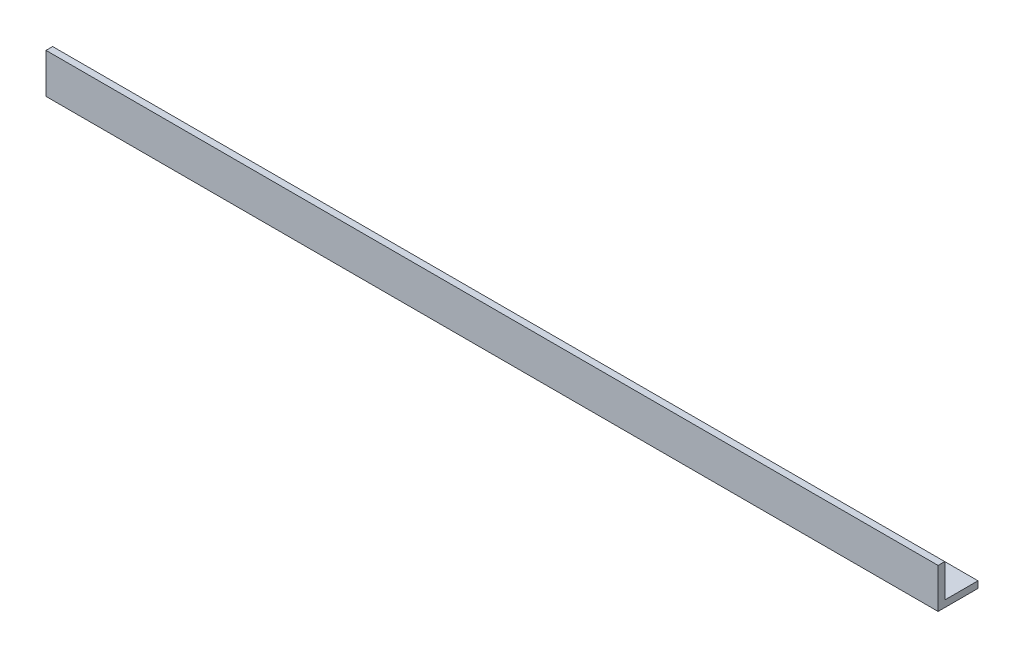
ISO-10303-21;
HEADER;
FILE_DESCRIPTION(('STEP AP214'),'2;1');
FILE_NAME('part.step','',(''),(''),'','','');
FILE_SCHEMA(('AUTOMOTIVE_DESIGN { 1 0 10303 214 1 1 1 1 }'));
ENDSEC;
DATA;
#1=APPLICATION_CONTEXT('core data for automotive mechanical design processes');
#2=APPLICATION_PROTOCOL_DEFINITION('international standard','automotive_design',2000,#1);
#3=PRODUCT_CONTEXT('',#1,'mechanical');
#4=PRODUCT('Part','Part','',(#3));
#5=PRODUCT_RELATED_PRODUCT_CATEGORY('part','',(#4));
#6=PRODUCT_DEFINITION_FORMATION('','',#4);
#7=PRODUCT_DEFINITION_CONTEXT('part definition',#1,'design');
#8=PRODUCT_DEFINITION('design','',#6,#7);
#9=PRODUCT_DEFINITION_SHAPE('','',#8);
#10=(LENGTH_UNIT() NAMED_UNIT(*) SI_UNIT(.MILLI.,.METRE.));
#11=(NAMED_UNIT(*) PLANE_ANGLE_UNIT() SI_UNIT($,.RADIAN.));
#12=(NAMED_UNIT(*) SI_UNIT($,.STERADIAN.) SOLID_ANGLE_UNIT());
#13=UNCERTAINTY_MEASURE_WITH_UNIT(LENGTH_MEASURE(1.E-05),#10,'distance_accuracy_value','');
#14=(GEOMETRIC_REPRESENTATION_CONTEXT(3) GLOBAL_UNCERTAINTY_ASSIGNED_CONTEXT((#13)) GLOBAL_UNIT_ASSIGNED_CONTEXT((#10,
#11,#12)) REPRESENTATION_CONTEXT('',''));
#15=CARTESIAN_POINT('',(0.,0.,0.));
#16=DIRECTION('',(0.,0.,1.));
#17=DIRECTION('',(1.,0.,0.));
#18=AXIS2_PLACEMENT_3D('',#15,#16,#17);
#19=CARTESIAN_POINT('',(426.,0.,-19.05));
#20=DIRECTION('',(0.,1.,0.));
#21=DIRECTION('',(0.,0.,1.));
#22=AXIS2_PLACEMENT_3D('',#19,#20,#21);
#23=PLANE('',#22);
#24=DIRECTION('',(0.,0.,-1.));
#25=VECTOR('',#24,1.);
#26=CARTESIAN_POINT('',(0.,0.,-19.05));
#27=LINE('',#26,#25);
#28=CARTESIAN_POINT('',(0.,0.,0.));
#29=VERTEX_POINT('',#28);
#30=CARTESIAN_POINT('',(0.,0.,-19.05));
#31=VERTEX_POINT('',#30);
#32=EDGE_CURVE('E117',#29,#31,#27,.T.);
#33=ORIENTED_EDGE('',*,*,#32,.T.);
#34=DIRECTION('',(-1.,0.,0.));
#35=VECTOR('',#34,1.);
#36=CARTESIAN_POINT('',(426.,0.,-19.05));
#37=LINE('',#36,#35);
#38=CARTESIAN_POINT('',(426.,0.,-19.05));
#39=VERTEX_POINT('',#38);
#40=EDGE_CURVE('E11',#39,#31,#37,.T.);
#41=ORIENTED_EDGE('',*,*,#40,.F.);
#42=DIRECTION('',(0.,0.,-1.));
#43=VECTOR('',#42,1.);
#44=CARTESIAN_POINT('',(426.,0.,-19.05));
#45=LINE('',#44,#43);
#46=CARTESIAN_POINT('',(426.,0.,0.));
#47=VERTEX_POINT('',#46);
#48=EDGE_CURVE('E127',#47,#39,#45,.T.);
#49=ORIENTED_EDGE('',*,*,#48,.F.);
#50=DIRECTION('',(-1.,0.,0.));
#51=VECTOR('',#50,1.);
#52=CARTESIAN_POINT('',(426.,0.,0.));
#53=LINE('',#52,#51);
#54=EDGE_CURVE('E113',#47,#29,#53,.T.);
#55=ORIENTED_EDGE('',*,*,#54,.T.);
#56=EDGE_LOOP('',(#33,#41,#49,#55));
#57=FACE_BOUND('',#56,.T.);
#58=ADVANCED_FACE('F33',(#57),#23,.F.);
#59=CARTESIAN_POINT('',(426.,3.175,-19.05));
#60=DIRECTION('',(0.,0.,1.));
#61=DIRECTION('',(0.,-1.,0.));
#62=AXIS2_PLACEMENT_3D('',#59,#60,#61);
#63=PLANE('',#62);
#64=DIRECTION('',(0.,1.,0.));
#65=VECTOR('',#64,1.);
#66=CARTESIAN_POINT('',(0.,3.175,-19.05));
#67=LINE('',#66,#65);
#68=CARTESIAN_POINT('',(0.,3.175,-19.05));
#69=VERTEX_POINT('',#68);
#70=EDGE_CURVE('E120',#31,#69,#67,.T.);
#71=ORIENTED_EDGE('',*,*,#70,.T.);
#72=DIRECTION('',(-1.,0.,0.));
#73=VECTOR('',#72,1.);
#74=CARTESIAN_POINT('',(426.,3.175,-19.05));
#75=LINE('',#74,#73);
#76=CARTESIAN_POINT('',(426.,3.175,-19.05));
#77=VERTEX_POINT('',#76);
#78=EDGE_CURVE('E41',#77,#69,#75,.T.);
#79=ORIENTED_EDGE('',*,*,#78,.F.);
#80=DIRECTION('',(0.,1.,0.));
#81=VECTOR('',#80,1.);
#82=CARTESIAN_POINT('',(426.,3.175,-19.05));
#83=LINE('',#82,#81);
#84=EDGE_CURVE('E86',#39,#77,#83,.T.);
#85=ORIENTED_EDGE('',*,*,#84,.F.);
#86=ORIENTED_EDGE('',*,*,#40,.T.);
#87=EDGE_LOOP('',(#71,#79,#85,#86));
#88=FACE_BOUND('',#87,.T.);
#89=ADVANCED_FACE('F151',(#88),#63,.F.);
#90=CARTESIAN_POINT('',(426.,3.175,-3.175));
#91=DIRECTION('',(0.,-1.,0.));
#92=DIRECTION('',(0.,0.,-1.));
#93=AXIS2_PLACEMENT_3D('',#90,#91,#92);
#94=PLANE('',#93);
#95=DIRECTION('',(0.,0.,1.));
#96=VECTOR('',#95,1.);
#97=CARTESIAN_POINT('',(0.,3.175,-3.175));
#98=LINE('',#97,#96);
#99=CARTESIAN_POINT('',(0.,3.175,-3.175));
#100=VERTEX_POINT('',#99);
#101=EDGE_CURVE('E122',#69,#100,#98,.T.);
#102=ORIENTED_EDGE('',*,*,#101,.T.);
#103=DIRECTION('',(-1.,0.,0.));
#104=VECTOR('',#103,1.);
#105=CARTESIAN_POINT('',(426.,3.175,-3.175));
#106=LINE('',#105,#104);
#107=CARTESIAN_POINT('',(426.,3.175,-3.175));
#108=VERTEX_POINT('',#107);
#109=EDGE_CURVE('E108',#108,#100,#106,.T.);
#110=ORIENTED_EDGE('',*,*,#109,.F.);
#111=DIRECTION('',(0.,0.,1.));
#112=VECTOR('',#111,1.);
#113=CARTESIAN_POINT('',(426.,3.175,-3.175));
#114=LINE('',#113,#112);
#115=EDGE_CURVE('E99',#77,#108,#114,.T.);
#116=ORIENTED_EDGE('',*,*,#115,.F.);
#117=ORIENTED_EDGE('',*,*,#78,.T.);
#118=EDGE_LOOP('',(#102,#110,#116,#117));
#119=FACE_BOUND('',#118,.T.);
#120=ADVANCED_FACE('F133',(#119),#94,.F.);
#121=CARTESIAN_POINT('',(426.,19.05,-3.175));
#122=DIRECTION('',(0.,0.,1.));
#123=DIRECTION('',(0.,-1.,0.));
#124=AXIS2_PLACEMENT_3D('',#121,#122,#123);
#125=PLANE('',#124);
#126=DIRECTION('',(0.,1.,0.));
#127=VECTOR('',#126,1.);
#128=CARTESIAN_POINT('',(0.,19.05,-3.175));
#129=LINE('',#128,#127);
#130=CARTESIAN_POINT('',(0.,19.05,-3.175));
#131=VERTEX_POINT('',#130);
#132=EDGE_CURVE('E107',#100,#131,#129,.T.);
#133=ORIENTED_EDGE('',*,*,#132,.T.);
#134=DIRECTION('',(-1.,0.,0.));
#135=VECTOR('',#134,1.);
#136=CARTESIAN_POINT('',(426.,19.05,-3.175));
#137=LINE('',#136,#135);
#138=CARTESIAN_POINT('',(426.,19.05,-3.175));
#139=VERTEX_POINT('',#138);
#140=EDGE_CURVE('E104',#139,#131,#137,.T.);
#141=ORIENTED_EDGE('',*,*,#140,.F.);
#142=DIRECTION('',(0.,1.,0.));
#143=VECTOR('',#142,1.);
#144=CARTESIAN_POINT('',(426.,19.05,-3.175));
#145=LINE('',#144,#143);
#146=EDGE_CURVE('E93',#108,#139,#145,.T.);
#147=ORIENTED_EDGE('',*,*,#146,.F.);
#148=ORIENTED_EDGE('',*,*,#109,.T.);
#149=EDGE_LOOP('',(#133,#141,#147,#148));
#150=FACE_BOUND('',#149,.T.);
#151=ADVANCED_FACE('F105',(#150),#125,.F.);
#152=CARTESIAN_POINT('',(426.,19.05,0.));
#153=DIRECTION('',(0.,-1.,0.));
#154=DIRECTION('',(0.,0.,-1.));
#155=AXIS2_PLACEMENT_3D('',#152,#153,#154);
#156=PLANE('',#155);
#157=DIRECTION('',(0.,0.,1.));
#158=VECTOR('',#157,1.);
#159=CARTESIAN_POINT('',(0.,19.05,0.));
#160=LINE('',#159,#158);
#161=CARTESIAN_POINT('',(0.,19.05,0.));
#162=VERTEX_POINT('',#161);
#163=EDGE_CURVE('E72',#131,#162,#160,.T.);
#164=ORIENTED_EDGE('',*,*,#163,.T.);
#165=DIRECTION('',(-1.,0.,0.));
#166=VECTOR('',#165,1.);
#167=CARTESIAN_POINT('',(426.,19.05,0.));
#168=LINE('',#167,#166);
#169=CARTESIAN_POINT('',(426.,19.05,0.));
#170=VERTEX_POINT('',#169);
#171=EDGE_CURVE('E109',#170,#162,#168,.T.);
#172=ORIENTED_EDGE('',*,*,#171,.F.);
#173=DIRECTION('',(0.,0.,1.));
#174=VECTOR('',#173,1.);
#175=CARTESIAN_POINT('',(426.,19.05,0.));
#176=LINE('',#175,#174);
#177=EDGE_CURVE('E97',#139,#170,#176,.T.);
#178=ORIENTED_EDGE('',*,*,#177,.F.);
#179=ORIENTED_EDGE('',*,*,#140,.T.);
#180=EDGE_LOOP('',(#164,#172,#178,#179));
#181=FACE_BOUND('',#180,.T.);
#182=ADVANCED_FACE('F111',(#181),#156,.F.);
#183=CARTESIAN_POINT('',(426.,0.,0.));
#184=DIRECTION('',(0.,0.,-1.));
#185=DIRECTION('',(-1.,0.,0.));
#186=AXIS2_PLACEMENT_3D('',#183,#184,#185);
#187=PLANE('',#186);
#188=DIRECTION('',(0.,-1.,0.));
#189=VECTOR('',#188,1.);
#190=CARTESIAN_POINT('',(0.,0.,0.));
#191=LINE('',#190,#189);
#192=EDGE_CURVE('E78',#162,#29,#191,.T.);
#193=ORIENTED_EDGE('',*,*,#192,.T.);
#194=ORIENTED_EDGE('',*,*,#54,.F.);
#195=DIRECTION('',(0.,-1.,0.));
#196=VECTOR('',#195,1.);
#197=CARTESIAN_POINT('',(426.,0.,0.));
#198=LINE('',#197,#196);
#199=EDGE_CURVE('E49',#170,#47,#198,.T.);
#200=ORIENTED_EDGE('',*,*,#199,.F.);
#201=ORIENTED_EDGE('',*,*,#171,.T.);
#202=EDGE_LOOP('',(#193,#194,#200,#201));
#203=FACE_BOUND('',#202,.T.);
#204=ADVANCED_FACE('F140',(#203),#187,.F.);
#205=CARTESIAN_POINT('',(426.,0.,0.));
#206=DIRECTION('',(-1.,0.,0.));
#207=DIRECTION('',(0.,0.,1.));
#208=AXIS2_PLACEMENT_3D('',#205,#206,#207);
#209=PLANE('',#208);
#210=ORIENTED_EDGE('',*,*,#48,.T.);
#211=ORIENTED_EDGE('',*,*,#84,.T.);
#212=ORIENTED_EDGE('',*,*,#115,.T.);
#213=ORIENTED_EDGE('',*,*,#146,.T.);
#214=ORIENTED_EDGE('',*,*,#177,.T.);
#215=ORIENTED_EDGE('',*,*,#199,.T.);
#216=EDGE_LOOP('',(#210,#211,#212,#213,#214,#215));
#217=FACE_BOUND('',#216,.T.);
#218=ADVANCED_FACE('F95',(#217),#209,.F.);
#219=CARTESIAN_POINT('',(0.,0.,0.));
#220=DIRECTION('',(-1.,0.,0.));
#221=DIRECTION('',(0.,0.,1.));
#222=AXIS2_PLACEMENT_3D('',#219,#220,#221);
#223=PLANE('',#222);
#224=ORIENTED_EDGE('',*,*,#32,.F.);
#225=ORIENTED_EDGE('',*,*,#192,.F.);
#226=ORIENTED_EDGE('',*,*,#163,.F.);
#227=ORIENTED_EDGE('',*,*,#132,.F.);
#228=ORIENTED_EDGE('',*,*,#101,.F.);
#229=ORIENTED_EDGE('',*,*,#70,.F.);
#230=EDGE_LOOP('',(#224,#225,#226,#227,#228,#229));
#231=FACE_BOUND('',#230,.T.);
#232=ADVANCED_FACE('F136',(#231),#223,.T.);
#233=CLOSED_SHELL('',(#58,#89,#120,#151,#182,#204,#218,#232));
#234=MANIFOLD_SOLID_BREP('B2',#233);
#235=ADVANCED_BREP_SHAPE_REPRESENTATION('',(#18,#234),#14);
#236=SHAPE_DEFINITION_REPRESENTATION(#9,#235);
ENDSEC;
END-ISO-10303-21;
